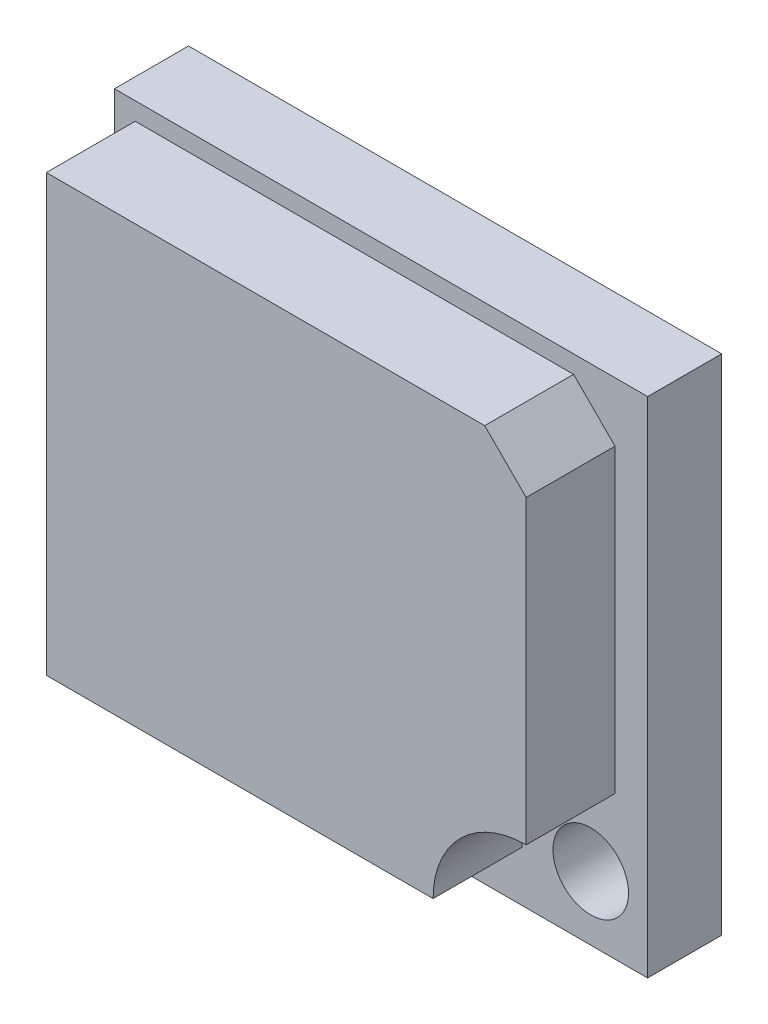
ISO-10303-21;
HEADER;
FILE_DESCRIPTION(('STEP AP214'),'2;1');
FILE_NAME('part.step','',(''),(''),'','','');
FILE_SCHEMA(('AUTOMOTIVE_DESIGN { 1 0 10303 214 1 1 1 1 }'));
ENDSEC;
DATA;
#1=APPLICATION_CONTEXT('core data for automotive mechanical design processes');
#2=APPLICATION_PROTOCOL_DEFINITION('international standard','automotive_design',2000,#1);
#3=PRODUCT_CONTEXT('',#1,'mechanical');
#4=PRODUCT('Part','Part','',(#3));
#5=PRODUCT_RELATED_PRODUCT_CATEGORY('part','',(#4));
#6=PRODUCT_DEFINITION_FORMATION('','',#4);
#7=PRODUCT_DEFINITION_CONTEXT('part definition',#1,'design');
#8=PRODUCT_DEFINITION('design','',#6,#7);
#9=PRODUCT_DEFINITION_SHAPE('','',#8);
#10=(LENGTH_UNIT() NAMED_UNIT(*) SI_UNIT(.MILLI.,.METRE.));
#11=(NAMED_UNIT(*) PLANE_ANGLE_UNIT() SI_UNIT($,.RADIAN.));
#12=(NAMED_UNIT(*) SI_UNIT($,.STERADIAN.) SOLID_ANGLE_UNIT());
#13=UNCERTAINTY_MEASURE_WITH_UNIT(LENGTH_MEASURE(1.E-05),#10,'distance_accuracy_value','');
#14=(GEOMETRIC_REPRESENTATION_CONTEXT(3) GLOBAL_UNCERTAINTY_ASSIGNED_CONTEXT((#13)) GLOBAL_UNIT_ASSIGNED_CONTEXT((#10,
#11,#12)) REPRESENTATION_CONTEXT('',''));
#15=CARTESIAN_POINT('',(0.,0.,0.));
#16=DIRECTION('',(0.,0.,1.));
#17=DIRECTION('',(1.,0.,0.));
#18=AXIS2_PLACEMENT_3D('',#15,#16,#17);
#19=CARTESIAN_POINT('',(0.,0.,2.5));
#20=DIRECTION('',(0.,0.,-1.));
#21=DIRECTION('',(-1.,0.,0.));
#22=AXIS2_PLACEMENT_3D('',#19,#20,#21);
#23=PLANE('',#22);
#24=CARTESIAN_POINT('',(16.0790234705672,2.15759117955875,2.5));
#25=DIRECTION('',(0.,0.,1.));
#26=DIRECTION('',(1.,0.,0.));
#27=AXIS2_PLACEMENT_3D('',#24,#25,#26);
#28=CIRCLE('',#27,1.275);
#29=CARTESIAN_POINT('',(17.3540234705672,2.15759117955875,2.5));
#30=VERTEX_POINT('',#29);
#31=EDGE_CURVE('E355',#30,#30,#28,.T.);
#32=ORIENTED_EDGE('',*,*,#31,.F.);
#33=EDGE_LOOP('',(#32));
#34=FACE_BOUND('',#33,.T.);
#35=DIRECTION('',(0.,-1.,0.));
#36=VECTOR('',#35,1.);
#37=CARTESIAN_POINT('',(0.,0.,2.5));
#38=LINE('',#37,#36);
#39=CARTESIAN_POINT('',(0.,17.,2.5));
#40=VERTEX_POINT('',#39);
#41=CARTESIAN_POINT('',(0.,0.,2.5));
#42=VERTEX_POINT('',#41);
#43=EDGE_CURVE('E152',#40,#42,#38,.T.);
#44=ORIENTED_EDGE('',*,*,#43,.T.);
#45=DIRECTION('',(1.,0.,0.));
#46=VECTOR('',#45,1.);
#47=CARTESIAN_POINT('',(0.,0.,2.5));
#48=LINE('',#47,#46);
#49=CARTESIAN_POINT('',(18.,0.,2.5));
#50=VERTEX_POINT('',#49);
#51=EDGE_CURVE('E156',#42,#50,#48,.T.);
#52=ORIENTED_EDGE('',*,*,#51,.T.);
#53=DIRECTION('',(0.,1.,0.));
#54=VECTOR('',#53,1.);
#55=CARTESIAN_POINT('',(18.,0.,2.5));
#56=LINE('',#55,#54);
#57=CARTESIAN_POINT('',(18.,17.,2.5));
#58=VERTEX_POINT('',#57);
#59=EDGE_CURVE('E160',#50,#58,#56,.T.);
#60=ORIENTED_EDGE('',*,*,#59,.T.);
#61=DIRECTION('',(-1.,0.,0.));
#62=VECTOR('',#61,1.);
#63=CARTESIAN_POINT('',(0.,17.,2.5));
#64=LINE('',#63,#62);
#65=EDGE_CURVE('E163',#58,#40,#64,.T.);
#66=ORIENTED_EDGE('',*,*,#65,.T.);
#67=EDGE_LOOP('',(#44,#52,#60,#66));
#68=FACE_BOUND('',#67,.T.);
#69=DIRECTION('',(-1.,0.,0.));
#70=VECTOR('',#69,1.);
#71=CARTESIAN_POINT('',(15.5,16.4,2.5));
#72=LINE('',#71,#70);
#73=CARTESIAN_POINT('',(15.5,16.4,2.5));
#74=VERTEX_POINT('',#73);
#75=CARTESIAN_POINT('',(0.700000000000004,16.4,2.5));
#76=VERTEX_POINT('',#75);
#77=EDGE_CURVE('E54',#74,#76,#72,.T.);
#78=ORIENTED_EDGE('',*,*,#77,.F.);
#79=DIRECTION('',(-0.70710678118655,0.707106781186545,0.));
#80=VECTOR('',#79,1.);
#81=CARTESIAN_POINT('',(16.9,15.,2.5));
#82=LINE('',#81,#80);
#83=CARTESIAN_POINT('',(16.9,15.,2.5));
#84=VERTEX_POINT('',#83);
#85=EDGE_CURVE('E58',#84,#74,#82,.T.);
#86=ORIENTED_EDGE('',*,*,#85,.F.);
#87=DIRECTION('',(0.,1.,0.));
#88=VECTOR('',#87,1.);
#89=CARTESIAN_POINT('',(16.9,4.84285705261196,2.5));
#90=LINE('',#89,#88);
#91=CARTESIAN_POINT('',(16.9,4.84285705261196,2.5));
#92=VERTEX_POINT('',#91);
#93=EDGE_CURVE('E384',#92,#84,#90,.T.);
#94=ORIENTED_EDGE('',*,*,#93,.F.);
#95=CARTESIAN_POINT('',(16.9,1.70000000000003,2.5));
#96=DIRECTION('',(0.,0.,-1.));
#97=DIRECTION('',(-1.,0.,0.));
#98=AXIS2_PLACEMENT_3D('',#95,#96,#97);
#99=CIRCLE('',#98,3.14285705261193);
#100=CARTESIAN_POINT('',(13.7571429473881,1.70000000000002,2.5));
#101=VERTEX_POINT('',#100);
#102=EDGE_CURVE('E380',#101,#92,#99,.T.);
#103=ORIENTED_EDGE('',*,*,#102,.F.);
#104=DIRECTION('',(1.,0.,0.));
#105=VECTOR('',#104,1.);
#106=CARTESIAN_POINT('',(0.700000000000007,1.70000000000003,2.5));
#107=LINE('',#106,#105);
#108=CARTESIAN_POINT('',(0.700000000000007,1.70000000000003,2.5));
#109=VERTEX_POINT('',#108);
#110=EDGE_CURVE('E376',#109,#101,#107,.T.);
#111=ORIENTED_EDGE('',*,*,#110,.F.);
#112=DIRECTION('',(0.,-1.,0.));
#113=VECTOR('',#112,1.);
#114=CARTESIAN_POINT('',(0.700000000000004,16.4,2.5));
#115=LINE('',#114,#113);
#116=EDGE_CURVE('E373',#76,#109,#115,.T.);
#117=ORIENTED_EDGE('',*,*,#116,.F.);
#118=EDGE_LOOP('',(#78,#86,#94,#103,#111,#117));
#119=FACE_BOUND('',#118,.T.);
#120=ADVANCED_FACE('F38',(#34,#68,#119),#23,.F.);
#121=CARTESIAN_POINT('',(0.,0.,2.5));
#122=DIRECTION('',(1.,0.,0.));
#123=DIRECTION('',(0.,1.,0.));
#124=AXIS2_PLACEMENT_3D('',#121,#122,#123);
#125=PLANE('',#124);
#126=DIRECTION('',(0.,-1.,0.));
#127=VECTOR('',#126,1.);
#128=CARTESIAN_POINT('',(0.,0.,0.));
#129=LINE('',#128,#127);
#130=CARTESIAN_POINT('',(0.,17.,0.));
#131=VERTEX_POINT('',#130);
#132=CARTESIAN_POINT('',(0.,0.,0.));
#133=VERTEX_POINT('',#132);
#134=EDGE_CURVE('E139',#131,#133,#129,.T.);
#135=ORIENTED_EDGE('',*,*,#134,.T.);
#136=DIRECTION('',(0.,0.,-1.));
#137=VECTOR('',#136,1.);
#138=CARTESIAN_POINT('',(0.,0.,2.5));
#139=LINE('',#138,#137);
#140=EDGE_CURVE('E11',#42,#133,#139,.T.);
#141=ORIENTED_EDGE('',*,*,#140,.F.);
#142=ORIENTED_EDGE('',*,*,#43,.F.);
#143=DIRECTION('',(0.,0.,-1.));
#144=VECTOR('',#143,1.);
#145=CARTESIAN_POINT('',(0.,17.,2.5));
#146=LINE('',#145,#144);
#147=EDGE_CURVE('E165',#40,#131,#146,.T.);
#148=ORIENTED_EDGE('',*,*,#147,.T.);
#149=EDGE_LOOP('',(#135,#141,#142,#148));
#150=FACE_BOUND('',#149,.T.);
#151=ADVANCED_FACE('F40',(#150),#125,.F.);
#152=CARTESIAN_POINT('',(0.,0.,2.5));
#153=DIRECTION('',(0.,1.,0.));
#154=DIRECTION('',(0.,0.,1.));
#155=AXIS2_PLACEMENT_3D('',#152,#153,#154);
#156=PLANE('',#155);
#157=DIRECTION('',(1.,0.,0.));
#158=VECTOR('',#157,1.);
#159=CARTESIAN_POINT('',(0.,0.,0.));
#160=LINE('',#159,#158);
#161=CARTESIAN_POINT('',(18.,0.,0.));
#162=VERTEX_POINT('',#161);
#163=EDGE_CURVE('E145',#133,#162,#160,.T.);
#164=ORIENTED_EDGE('',*,*,#163,.T.);
#165=DIRECTION('',(0.,0.,-1.));
#166=VECTOR('',#165,1.);
#167=CARTESIAN_POINT('',(18.,0.,2.5));
#168=LINE('',#167,#166);
#169=EDGE_CURVE('E47',#50,#162,#168,.T.);
#170=ORIENTED_EDGE('',*,*,#169,.F.);
#171=ORIENTED_EDGE('',*,*,#51,.F.);
#172=ORIENTED_EDGE('',*,*,#140,.T.);
#173=EDGE_LOOP('',(#164,#170,#171,#172));
#174=FACE_BOUND('',#173,.T.);
#175=ADVANCED_FACE('F202',(#174),#156,.F.);
#176=CARTESIAN_POINT('',(18.,0.,2.5));
#177=DIRECTION('',(-1.,0.,0.));
#178=DIRECTION('',(0.,0.,1.));
#179=AXIS2_PLACEMENT_3D('',#176,#177,#178);
#180=PLANE('',#179);
#181=DIRECTION('',(0.,1.,0.));
#182=VECTOR('',#181,1.);
#183=CARTESIAN_POINT('',(18.,0.,0.));
#184=LINE('',#183,#182);
#185=CARTESIAN_POINT('',(18.,17.,0.));
#186=VERTEX_POINT('',#185);
#187=EDGE_CURVE('E169',#162,#186,#184,.T.);
#188=ORIENTED_EDGE('',*,*,#187,.T.);
#189=DIRECTION('',(0.,0.,-1.));
#190=VECTOR('',#189,1.);
#191=CARTESIAN_POINT('',(18.,17.,2.5));
#192=LINE('',#191,#190);
#193=EDGE_CURVE('E177',#58,#186,#192,.T.);
#194=ORIENTED_EDGE('',*,*,#193,.F.);
#195=ORIENTED_EDGE('',*,*,#59,.F.);
#196=ORIENTED_EDGE('',*,*,#169,.T.);
#197=EDGE_LOOP('',(#188,#194,#195,#196));
#198=FACE_BOUND('',#197,.T.);
#199=ADVANCED_FACE('F187',(#198),#180,.F.);
#200=CARTESIAN_POINT('',(0.,17.,2.5));
#201=DIRECTION('',(0.,-1.,0.));
#202=DIRECTION('',(0.,0.,-1.));
#203=AXIS2_PLACEMENT_3D('',#200,#201,#202);
#204=PLANE('',#203);
#205=DIRECTION('',(-1.,0.,0.));
#206=VECTOR('',#205,1.);
#207=CARTESIAN_POINT('',(0.,17.,0.));
#208=LINE('',#207,#206);
#209=EDGE_CURVE('E157',#186,#131,#208,.T.);
#210=ORIENTED_EDGE('',*,*,#209,.T.);
#211=ORIENTED_EDGE('',*,*,#147,.F.);
#212=ORIENTED_EDGE('',*,*,#65,.F.);
#213=ORIENTED_EDGE('',*,*,#193,.T.);
#214=EDGE_LOOP('',(#210,#211,#212,#213));
#215=FACE_BOUND('',#214,.T.);
#216=ADVANCED_FACE('F196',(#215),#204,.F.);
#217=CARTESIAN_POINT('',(0.,0.,0.));
#218=DIRECTION('',(0.,0.,-1.));
#219=DIRECTION('',(-1.,0.,0.));
#220=AXIS2_PLACEMENT_3D('',#217,#218,#219);
#221=PLANE('',#220);
#222=CARTESIAN_POINT('',(16.0790234705672,2.15759117955875,0.));
#223=DIRECTION('',(0.,0.,1.));
#224=DIRECTION('',(1.,0.,0.));
#225=AXIS2_PLACEMENT_3D('',#222,#223,#224);
#226=CIRCLE('',#225,1.275);
#227=CARTESIAN_POINT('',(17.3540234705672,2.15759117955875,0.));
#228=VERTEX_POINT('',#227);
#229=EDGE_CURVE('E353',#228,#228,#226,.T.);
#230=ORIENTED_EDGE('',*,*,#229,.T.);
#231=EDGE_LOOP('',(#230));
#232=FACE_BOUND('',#231,.T.);
#233=ORIENTED_EDGE('',*,*,#134,.F.);
#234=ORIENTED_EDGE('',*,*,#209,.F.);
#235=ORIENTED_EDGE('',*,*,#187,.F.);
#236=ORIENTED_EDGE('',*,*,#163,.F.);
#237=EDGE_LOOP('',(#233,#234,#235,#236));
#238=FACE_BOUND('',#237,.T.);
#239=ADVANCED_FACE('F193',(#232,#238),#221,.T.);
#240=CARTESIAN_POINT('',(15.5,16.4,5.5));
#241=DIRECTION('',(0.,-1.,0.));
#242=DIRECTION('',(1.,0.,0.));
#243=AXIS2_PLACEMENT_3D('',#240,#241,#242);
#244=PLANE('',#243);
#245=ORIENTED_EDGE('',*,*,#77,.T.);
#246=DIRECTION('',(0.,0.,-1.));
#247=VECTOR('',#246,1.);
#248=CARTESIAN_POINT('',(0.700000000000004,16.4,5.5));
#249=LINE('',#248,#247);
#250=CARTESIAN_POINT('',(0.700000000000004,16.4,5.5));
#251=VERTEX_POINT('',#250);
#252=EDGE_CURVE('E119',#251,#76,#249,.T.);
#253=ORIENTED_EDGE('',*,*,#252,.F.);
#254=DIRECTION('',(-1.,0.,0.));
#255=VECTOR('',#254,1.);
#256=CARTESIAN_POINT('',(15.5,16.4,5.5));
#257=LINE('',#256,#255);
#258=CARTESIAN_POINT('',(15.5,16.4,5.5));
#259=VERTEX_POINT('',#258);
#260=EDGE_CURVE('E126',#259,#251,#257,.T.);
#261=ORIENTED_EDGE('',*,*,#260,.F.);
#262=DIRECTION('',(0.,0.,-1.));
#263=VECTOR('',#262,1.);
#264=CARTESIAN_POINT('',(15.5,16.4,5.5));
#265=LINE('',#264,#263);
#266=EDGE_CURVE('E370',#259,#74,#265,.T.);
#267=ORIENTED_EDGE('',*,*,#266,.T.);
#268=EDGE_LOOP('',(#245,#253,#261,#267));
#269=FACE_BOUND('',#268,.T.);
#270=ADVANCED_FACE('F137',(#269),#244,.F.);
#271=CARTESIAN_POINT('',(0.700000000000004,16.4,5.5));
#272=DIRECTION('',(1.,0.,0.));
#273=DIRECTION('',(0.,1.,0.));
#274=AXIS2_PLACEMENT_3D('',#271,#272,#273);
#275=PLANE('',#274);
#276=ORIENTED_EDGE('',*,*,#116,.T.);
#277=DIRECTION('',(0.,0.,-1.));
#278=VECTOR('',#277,1.);
#279=CARTESIAN_POINT('',(0.700000000000007,1.70000000000003,5.5));
#280=LINE('',#279,#278);
#281=CARTESIAN_POINT('',(0.700000000000007,1.70000000000003,5.5));
#282=VERTEX_POINT('',#281);
#283=EDGE_CURVE('E121',#282,#109,#280,.T.);
#284=ORIENTED_EDGE('',*,*,#283,.F.);
#285=DIRECTION('',(0.,-1.,0.));
#286=VECTOR('',#285,1.);
#287=CARTESIAN_POINT('',(0.700000000000004,16.4,5.5));
#288=LINE('',#287,#286);
#289=EDGE_CURVE('E114',#251,#282,#288,.T.);
#290=ORIENTED_EDGE('',*,*,#289,.F.);
#291=ORIENTED_EDGE('',*,*,#252,.T.);
#292=EDGE_LOOP('',(#276,#284,#290,#291));
#293=FACE_BOUND('',#292,.T.);
#294=ADVANCED_FACE('F117',(#293),#275,.F.);
#295=CARTESIAN_POINT('',(0.700000000000007,1.70000000000003,5.5));
#296=DIRECTION('',(0.,1.,0.));
#297=DIRECTION('',(-1.,0.,0.));
#298=AXIS2_PLACEMENT_3D('',#295,#296,#297);
#299=PLANE('',#298);
#300=ORIENTED_EDGE('',*,*,#110,.T.);
#301=DIRECTION('',(0.,0.,-1.));
#302=VECTOR('',#301,1.);
#303=CARTESIAN_POINT('',(13.7571429473881,1.70000000000002,5.5));
#304=LINE('',#303,#302);
#305=CARTESIAN_POINT('',(13.7571429473881,1.70000000000002,5.5));
#306=VERTEX_POINT('',#305);
#307=EDGE_CURVE('E148',#306,#101,#304,.T.);
#308=ORIENTED_EDGE('',*,*,#307,.F.);
#309=DIRECTION('',(1.,0.,0.));
#310=VECTOR('',#309,1.);
#311=CARTESIAN_POINT('',(0.700000000000007,1.70000000000003,5.5));
#312=LINE('',#311,#310);
#313=EDGE_CURVE('E125',#282,#306,#312,.T.);
#314=ORIENTED_EDGE('',*,*,#313,.F.);
#315=ORIENTED_EDGE('',*,*,#283,.T.);
#316=EDGE_LOOP('',(#300,#308,#314,#315));
#317=FACE_BOUND('',#316,.T.);
#318=ADVANCED_FACE('F238',(#317),#299,.F.);
#319=CARTESIAN_POINT('',(16.9,1.70000000000003,5.5));
#320=DIRECTION('',(0.,0.,-1.));
#321=DIRECTION('',(-1.,0.,0.));
#322=AXIS2_PLACEMENT_3D('',#319,#320,#321);
#323=CYLINDRICAL_SURFACE('',#322,3.14285705261193);
#324=ORIENTED_EDGE('',*,*,#102,.T.);
#325=DIRECTION('',(0.,0.,-1.));
#326=VECTOR('',#325,1.);
#327=CARTESIAN_POINT('',(16.9,4.84285705261196,5.5));
#328=LINE('',#327,#326);
#329=CARTESIAN_POINT('',(16.9,4.84285705261196,5.5));
#330=VERTEX_POINT('',#329);
#331=EDGE_CURVE('E394',#330,#92,#328,.T.);
#332=ORIENTED_EDGE('',*,*,#331,.F.);
#333=CARTESIAN_POINT('',(16.9,1.70000000000003,5.5));
#334=DIRECTION('',(0.,0.,-1.));
#335=DIRECTION('',(-1.,0.,0.));
#336=AXIS2_PLACEMENT_3D('',#333,#334,#335);
#337=CIRCLE('',#336,3.14285705261193);
#338=EDGE_CURVE('E364',#306,#330,#337,.T.);
#339=ORIENTED_EDGE('',*,*,#338,.F.);
#340=ORIENTED_EDGE('',*,*,#307,.T.);
#341=EDGE_LOOP('',(#324,#332,#339,#340));
#342=FACE_BOUND('',#341,.T.);
#343=ADVANCED_FACE('F243',(#342),#323,.F.);
#344=CARTESIAN_POINT('',(16.9,4.84285705261196,5.5));
#345=DIRECTION('',(-1.,0.,0.));
#346=DIRECTION('',(0.,0.,1.));
#347=AXIS2_PLACEMENT_3D('',#344,#345,#346);
#348=PLANE('',#347);
#349=ORIENTED_EDGE('',*,*,#93,.T.);
#350=DIRECTION('',(0.,0.,-1.));
#351=VECTOR('',#350,1.);
#352=CARTESIAN_POINT('',(16.9,15.,5.5));
#353=LINE('',#352,#351);
#354=CARTESIAN_POINT('',(16.9,15.,5.5));
#355=VERTEX_POINT('',#354);
#356=EDGE_CURVE('E390',#355,#84,#353,.T.);
#357=ORIENTED_EDGE('',*,*,#356,.F.);
#358=DIRECTION('',(0.,1.,0.));
#359=VECTOR('',#358,1.);
#360=CARTESIAN_POINT('',(16.9,4.84285705261196,5.5));
#361=LINE('',#360,#359);
#362=EDGE_CURVE('E366',#330,#355,#361,.T.);
#363=ORIENTED_EDGE('',*,*,#362,.F.);
#364=ORIENTED_EDGE('',*,*,#331,.T.);
#365=EDGE_LOOP('',(#349,#357,#363,#364));
#366=FACE_BOUND('',#365,.T.);
#367=ADVANCED_FACE('F250',(#366),#348,.F.);
#368=CARTESIAN_POINT('',(16.9,15.,5.5));
#369=DIRECTION('',(-0.707106781186545,-0.70710678118655,0.));
#370=DIRECTION('',(0.70710678118655,-0.707106781186545,0.));
#371=AXIS2_PLACEMENT_3D('',#368,#369,#370);
#372=PLANE('',#371);
#373=ORIENTED_EDGE('',*,*,#85,.T.);
#374=ORIENTED_EDGE('',*,*,#266,.F.);
#375=DIRECTION('',(-0.70710678118655,0.707106781186545,0.));
#376=VECTOR('',#375,1.);
#377=CARTESIAN_POINT('',(16.9,15.,5.5));
#378=LINE('',#377,#376);
#379=EDGE_CURVE('E131',#355,#259,#378,.T.);
#380=ORIENTED_EDGE('',*,*,#379,.F.);
#381=ORIENTED_EDGE('',*,*,#356,.T.);
#382=EDGE_LOOP('',(#373,#374,#380,#381));
#383=FACE_BOUND('',#382,.T.);
#384=ADVANCED_FACE('F257',(#383),#372,.F.);
#385=CARTESIAN_POINT('',(16.9,1.70000000000003,5.5));
#386=DIRECTION('',(0.,0.,-1.));
#387=DIRECTION('',(-1.,0.,0.));
#388=AXIS2_PLACEMENT_3D('',#385,#386,#387);
#389=PLANE('',#388);
#390=ORIENTED_EDGE('',*,*,#260,.T.);
#391=ORIENTED_EDGE('',*,*,#289,.T.);
#392=ORIENTED_EDGE('',*,*,#313,.T.);
#393=ORIENTED_EDGE('',*,*,#338,.T.);
#394=ORIENTED_EDGE('',*,*,#362,.T.);
#395=ORIENTED_EDGE('',*,*,#379,.T.);
#396=EDGE_LOOP('',(#390,#391,#392,#393,#394,#395));
#397=FACE_BOUND('',#396,.T.);
#398=ADVANCED_FACE('F129',(#397),#389,.F.);
#399=CARTESIAN_POINT('',(16.0790234705672,2.15759117955875,0.));
#400=DIRECTION('',(0.,0.,1.));
#401=DIRECTION('',(1.,0.,0.));
#402=AXIS2_PLACEMENT_3D('',#399,#400,#401);
#403=CYLINDRICAL_SURFACE('',#402,1.275);
#404=ORIENTED_EDGE('',*,*,#229,.F.);
#405=EDGE_LOOP('',(#404));
#406=FACE_BOUND('',#405,.T.);
#407=ORIENTED_EDGE('',*,*,#31,.T.);
#408=EDGE_LOOP('',(#407));
#409=FACE_BOUND('',#408,.T.);
#410=ADVANCED_FACE('F270',(#406,#409),#403,.F.);
#411=CLOSED_SHELL('',(#120,#151,#175,#199,#216,#239,#270,#294,#318,#343,#367,#384,#398,#410));
#412=MANIFOLD_SOLID_BREP('B2',#411);
#413=ADVANCED_BREP_SHAPE_REPRESENTATION('',(#18,#412),#14);
#414=SHAPE_DEFINITION_REPRESENTATION(#9,#413);
ENDSEC;
END-ISO-10303-21;
